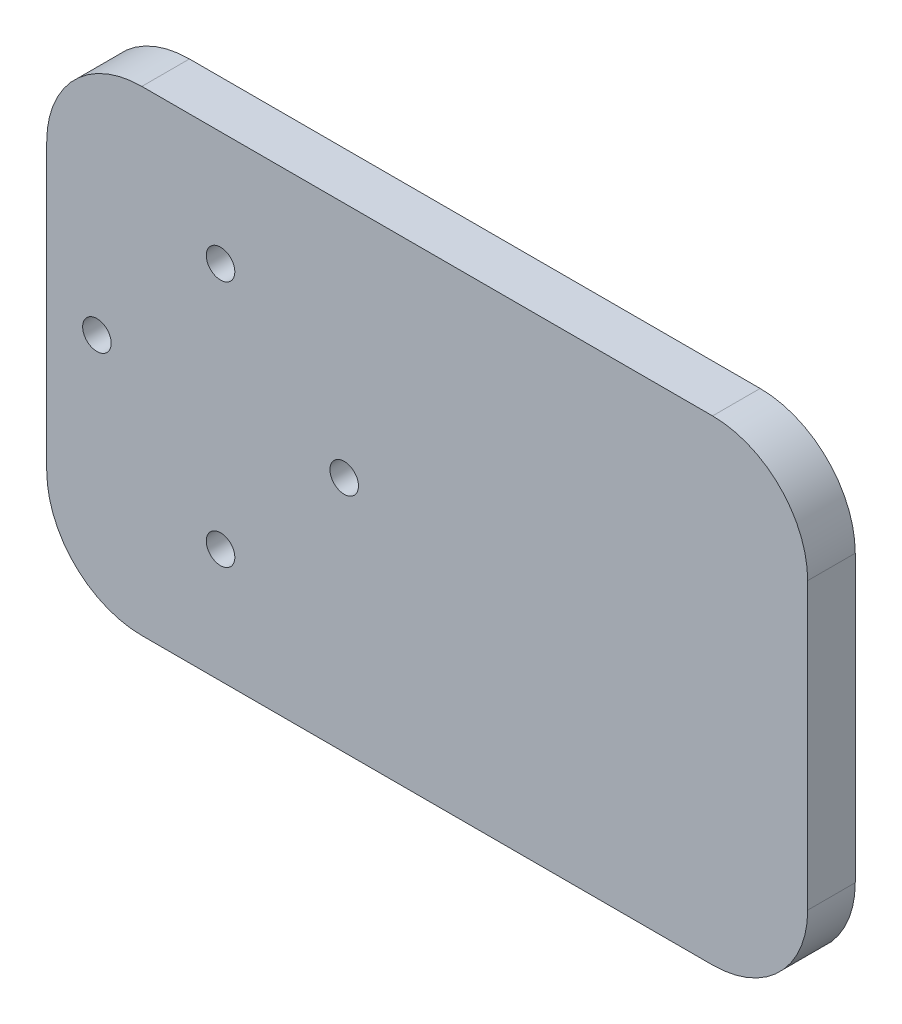
ISO-10303-21;
HEADER;
FILE_DESCRIPTION(('STEP AP214'),'2;1');
FILE_NAME('part.step','',(''),(''),'','','');
FILE_SCHEMA(('AUTOMOTIVE_DESIGN { 1 0 10303 214 1 1 1 1 }'));
ENDSEC;
DATA;
#1=APPLICATION_CONTEXT('core data for automotive mechanical design processes');
#2=APPLICATION_PROTOCOL_DEFINITION('international standard','automotive_design',2000,#1);
#3=PRODUCT_CONTEXT('',#1,'mechanical');
#4=PRODUCT('Part','Part','',(#3));
#5=PRODUCT_RELATED_PRODUCT_CATEGORY('part','',(#4));
#6=PRODUCT_DEFINITION_FORMATION('','',#4);
#7=PRODUCT_DEFINITION_CONTEXT('part definition',#1,'design');
#8=PRODUCT_DEFINITION('design','',#6,#7);
#9=PRODUCT_DEFINITION_SHAPE('','',#8);
#10=(LENGTH_UNIT() NAMED_UNIT(*) SI_UNIT(.MILLI.,.METRE.));
#11=(NAMED_UNIT(*) PLANE_ANGLE_UNIT() SI_UNIT($,.RADIAN.));
#12=(NAMED_UNIT(*) SI_UNIT($,.STERADIAN.) SOLID_ANGLE_UNIT());
#13=UNCERTAINTY_MEASURE_WITH_UNIT(LENGTH_MEASURE(1.E-05),#10,'distance_accuracy_value','');
#14=(GEOMETRIC_REPRESENTATION_CONTEXT(3) GLOBAL_UNCERTAINTY_ASSIGNED_CONTEXT((#13)) GLOBAL_UNIT_ASSIGNED_CONTEXT((#10,
#11,#12)) REPRESENTATION_CONTEXT('',''));
#15=CARTESIAN_POINT('',(0.,0.,0.));
#16=DIRECTION('',(0.,0.,1.));
#17=DIRECTION('',(1.,0.,0.));
#18=AXIS2_PLACEMENT_3D('',#15,#16,#17);
#19=CARTESIAN_POINT('',(40.,25.,5.));
#20=DIRECTION('',(-1.,0.,0.));
#21=DIRECTION('',(0.,0.,1.));
#22=AXIS2_PLACEMENT_3D('',#19,#20,#21);
#23=PLANE('',#22);
#24=DIRECTION('',(0.,1.,0.));
#25=VECTOR('',#24,1.);
#26=CARTESIAN_POINT('',(40.,25.,5.));
#27=LINE('',#26,#25);
#28=CARTESIAN_POINT('',(40.,-15.,5.));
#29=VERTEX_POINT('',#28);
#30=CARTESIAN_POINT('',(40.,15.,5.));
#31=VERTEX_POINT('',#30);
#32=EDGE_CURVE('E127',#29,#31,#27,.T.);
#33=ORIENTED_EDGE('',*,*,#32,.F.);
#34=DIRECTION('',(0.,0.,-1.));
#35=VECTOR('',#34,1.);
#36=CARTESIAN_POINT('',(40.,-15.,5.));
#37=LINE('',#36,#35);
#38=CARTESIAN_POINT('',(40.,-15.,0.));
#39=VERTEX_POINT('',#38);
#40=EDGE_CURVE('E11',#29,#39,#37,.T.);
#41=ORIENTED_EDGE('',*,*,#40,.T.);
#42=DIRECTION('',(0.,1.,0.));
#43=VECTOR('',#42,1.);
#44=CARTESIAN_POINT('',(40.,25.,0.));
#45=LINE('',#44,#43);
#46=CARTESIAN_POINT('',(40.,15.,0.));
#47=VERTEX_POINT('',#46);
#48=EDGE_CURVE('E158',#39,#47,#45,.T.);
#49=ORIENTED_EDGE('',*,*,#48,.T.);
#50=DIRECTION('',(0.,0.,-1.));
#51=VECTOR('',#50,1.);
#52=CARTESIAN_POINT('',(40.,15.,5.));
#53=LINE('',#52,#51);
#54=EDGE_CURVE('E41',#47,#31,#53,.F.);
#55=ORIENTED_EDGE('',*,*,#54,.T.);
#56=EDGE_LOOP('',(#33,#41,#49,#55));
#57=FACE_BOUND('',#56,.T.);
#58=ADVANCED_FACE('F33',(#57),#23,.F.);
#59=CARTESIAN_POINT('',(-40.,25.,5.));
#60=DIRECTION('',(0.,-1.,0.));
#61=DIRECTION('',(0.,0.,-1.));
#62=AXIS2_PLACEMENT_3D('',#59,#60,#61);
#63=PLANE('',#62);
#64=DIRECTION('',(-1.,0.,0.));
#65=VECTOR('',#64,1.);
#66=CARTESIAN_POINT('',(-40.,25.,0.));
#67=LINE('',#66,#65);
#68=CARTESIAN_POINT('',(30.,25.,0.));
#69=VERTEX_POINT('',#68);
#70=CARTESIAN_POINT('',(-30.,25.,0.));
#71=VERTEX_POINT('',#70);
#72=EDGE_CURVE('E132',#69,#71,#67,.T.);
#73=ORIENTED_EDGE('',*,*,#72,.T.);
#74=DIRECTION('',(0.,0.,-1.));
#75=VECTOR('',#74,1.);
#76=CARTESIAN_POINT('',(-30.,25.,5.));
#77=LINE('',#76,#75);
#78=CARTESIAN_POINT('',(-30.,25.,5.));
#79=VERTEX_POINT('',#78);
#80=EDGE_CURVE('E48',#71,#79,#77,.F.);
#81=ORIENTED_EDGE('',*,*,#80,.T.);
#82=DIRECTION('',(-1.,0.,0.));
#83=VECTOR('',#82,1.);
#84=CARTESIAN_POINT('',(-40.,25.,5.));
#85=LINE('',#84,#83);
#86=CARTESIAN_POINT('',(30.,25.,5.));
#87=VERTEX_POINT('',#86);
#88=EDGE_CURVE('E130',#87,#79,#85,.T.);
#89=ORIENTED_EDGE('',*,*,#88,.F.);
#90=DIRECTION('',(0.,0.,-1.));
#91=VECTOR('',#90,1.);
#92=CARTESIAN_POINT('',(30.,25.,5.));
#93=LINE('',#92,#91);
#94=EDGE_CURVE('E150',#87,#69,#93,.T.);
#95=ORIENTED_EDGE('',*,*,#94,.T.);
#96=EDGE_LOOP('',(#73,#81,#89,#95));
#97=FACE_BOUND('',#96,.T.);
#98=ADVANCED_FACE('F165',(#97),#63,.F.);
#99=CARTESIAN_POINT('',(-40.,25.,5.));
#100=DIRECTION('',(1.,0.,0.));
#101=DIRECTION('',(0.,1.,0.));
#102=AXIS2_PLACEMENT_3D('',#99,#100,#101);
#103=PLANE('',#102);
#104=DIRECTION('',(0.,-1.,0.));
#105=VECTOR('',#104,1.);
#106=CARTESIAN_POINT('',(-40.,25.,0.));
#107=LINE('',#106,#105);
#108=CARTESIAN_POINT('',(-40.,15.,0.));
#109=VERTEX_POINT('',#108);
#110=CARTESIAN_POINT('',(-40.,-15.,0.));
#111=VERTEX_POINT('',#110);
#112=EDGE_CURVE('E128',#109,#111,#107,.T.);
#113=ORIENTED_EDGE('',*,*,#112,.T.);
#114=DIRECTION('',(0.,0.,-1.));
#115=VECTOR('',#114,1.);
#116=CARTESIAN_POINT('',(-40.,-15.,5.));
#117=LINE('',#116,#115);
#118=CARTESIAN_POINT('',(-40.,-15.,5.));
#119=VERTEX_POINT('',#118);
#120=EDGE_CURVE('E105',#111,#119,#117,.F.);
#121=ORIENTED_EDGE('',*,*,#120,.T.);
#122=DIRECTION('',(0.,-1.,0.));
#123=VECTOR('',#122,1.);
#124=CARTESIAN_POINT('',(-40.,25.,5.));
#125=LINE('',#124,#123);
#126=CARTESIAN_POINT('',(-40.,15.,5.));
#127=VERTEX_POINT('',#126);
#128=EDGE_CURVE('E170',#127,#119,#125,.T.);
#129=ORIENTED_EDGE('',*,*,#128,.F.);
#130=DIRECTION('',(0.,0.,-1.));
#131=VECTOR('',#130,1.);
#132=CARTESIAN_POINT('',(-40.,15.,5.));
#133=LINE('',#132,#131);
#134=EDGE_CURVE('E110',#127,#109,#133,.T.);
#135=ORIENTED_EDGE('',*,*,#134,.T.);
#136=EDGE_LOOP('',(#113,#121,#129,#135));
#137=FACE_BOUND('',#136,.T.);
#138=ADVANCED_FACE('F233',(#137),#103,.F.);
#139=CARTESIAN_POINT('',(-40.,-25.,5.));
#140=DIRECTION('',(0.,1.,0.));
#141=DIRECTION('',(0.,0.,1.));
#142=AXIS2_PLACEMENT_3D('',#139,#140,#141);
#143=PLANE('',#142);
#144=DIRECTION('',(1.,0.,0.));
#145=VECTOR('',#144,1.);
#146=CARTESIAN_POINT('',(-40.,-25.,5.));
#147=LINE('',#146,#145);
#148=CARTESIAN_POINT('',(-30.,-25.,5.));
#149=VERTEX_POINT('',#148);
#150=CARTESIAN_POINT('',(30.,-25.,5.));
#151=VERTEX_POINT('',#150);
#152=EDGE_CURVE('E120',#149,#151,#147,.T.);
#153=ORIENTED_EDGE('',*,*,#152,.F.);
#154=DIRECTION('',(0.,0.,-1.));
#155=VECTOR('',#154,1.);
#156=CARTESIAN_POINT('',(-30.,-25.,5.));
#157=LINE('',#156,#155);
#158=CARTESIAN_POINT('',(-30.,-25.,0.));
#159=VERTEX_POINT('',#158);
#160=EDGE_CURVE('E104',#149,#159,#157,.T.);
#161=ORIENTED_EDGE('',*,*,#160,.T.);
#162=DIRECTION('',(1.,0.,0.));
#163=VECTOR('',#162,1.);
#164=CARTESIAN_POINT('',(-40.,-25.,0.));
#165=LINE('',#164,#163);
#166=CARTESIAN_POINT('',(30.,-25.,0.));
#167=VERTEX_POINT('',#166);
#168=EDGE_CURVE('E117',#159,#167,#165,.T.);
#169=ORIENTED_EDGE('',*,*,#168,.T.);
#170=DIRECTION('',(0.,0.,-1.));
#171=VECTOR('',#170,1.);
#172=CARTESIAN_POINT('',(30.,-25.,5.));
#173=LINE('',#172,#171);
#174=EDGE_CURVE('E122',#167,#151,#173,.F.);
#175=ORIENTED_EDGE('',*,*,#174,.T.);
#176=EDGE_LOOP('',(#153,#161,#169,#175));
#177=FACE_BOUND('',#176,.T.);
#178=ADVANCED_FACE('F116',(#177),#143,.F.);
#179=CARTESIAN_POINT('',(0.,0.,5.));
#180=DIRECTION('',(0.,0.,1.));
#181=DIRECTION('',(1.,0.,0.));
#182=AXIS2_PLACEMENT_3D('',#179,#180,#181);
#183=PLANE('',#182);
#184=CARTESIAN_POINT('',(-34.7271822940433,0.,5.));
#185=DIRECTION('',(0.,0.,1.));
#186=DIRECTION('',(1.,0.,0.));
#187=AXIS2_PLACEMENT_3D('',#184,#185,#186);
#188=CIRCLE('',#187,1.5);
#189=CARTESIAN_POINT('',(-33.2271822940433,0.,5.));
#190=VERTEX_POINT('',#189);
#191=EDGE_CURVE('E191',#190,#190,#188,.T.);
#192=ORIENTED_EDGE('',*,*,#191,.F.);
#193=EDGE_LOOP('',(#192));
#194=FACE_BOUND('',#193,.T.);
#195=CARTESIAN_POINT('',(-21.7271822940433,-13.,5.));
#196=DIRECTION('',(0.,0.,1.));
#197=DIRECTION('',(1.,0.,0.));
#198=AXIS2_PLACEMENT_3D('',#195,#196,#197);
#199=CIRCLE('',#198,1.5);
#200=CARTESIAN_POINT('',(-20.2271822940433,-13.,5.));
#201=VERTEX_POINT('',#200);
#202=EDGE_CURVE('E185',#201,#201,#199,.T.);
#203=ORIENTED_EDGE('',*,*,#202,.F.);
#204=EDGE_LOOP('',(#203));
#205=FACE_BOUND('',#204,.T.);
#206=CARTESIAN_POINT('',(-8.72718229404334,0.,5.));
#207=DIRECTION('',(0.,0.,1.));
#208=DIRECTION('',(1.,0.,0.));
#209=AXIS2_PLACEMENT_3D('',#206,#207,#208);
#210=CIRCLE('',#209,1.5);
#211=CARTESIAN_POINT('',(-7.22718229404334,0.,5.));
#212=VERTEX_POINT('',#211);
#213=EDGE_CURVE('E179',#212,#212,#210,.T.);
#214=ORIENTED_EDGE('',*,*,#213,.F.);
#215=EDGE_LOOP('',(#214));
#216=FACE_BOUND('',#215,.T.);
#217=CARTESIAN_POINT('',(-21.7271822940433,13.,5.));
#218=DIRECTION('',(0.,0.,1.));
#219=DIRECTION('',(1.,0.,0.));
#220=AXIS2_PLACEMENT_3D('',#217,#218,#219);
#221=CIRCLE('',#220,1.5);
#222=CARTESIAN_POINT('',(-20.2271822940433,13.,5.));
#223=VERTEX_POINT('',#222);
#224=EDGE_CURVE('E173',#223,#223,#221,.T.);
#225=ORIENTED_EDGE('',*,*,#224,.F.);
#226=EDGE_LOOP('',(#225));
#227=FACE_BOUND('',#226,.T.);
#228=ORIENTED_EDGE('',*,*,#128,.T.);
#229=CARTESIAN_POINT('',(-30.,-15.,5.));
#230=DIRECTION('',(0.,0.,1.));
#231=DIRECTION('',(1.,0.,0.));
#232=AXIS2_PLACEMENT_3D('',#229,#230,#231);
#233=CIRCLE('',#232,10.);
#234=EDGE_CURVE('E148',#119,#149,#233,.T.);
#235=ORIENTED_EDGE('',*,*,#234,.T.);
#236=ORIENTED_EDGE('',*,*,#152,.T.);
#237=CARTESIAN_POINT('',(30.,-15.,5.));
#238=DIRECTION('',(0.,0.,1.));
#239=DIRECTION('',(1.,0.,0.));
#240=AXIS2_PLACEMENT_3D('',#237,#238,#239);
#241=CIRCLE('',#240,10.);
#242=EDGE_CURVE('E144',#151,#29,#241,.T.);
#243=ORIENTED_EDGE('',*,*,#242,.T.);
#244=ORIENTED_EDGE('',*,*,#32,.T.);
#245=CARTESIAN_POINT('',(30.,15.,5.));
#246=DIRECTION('',(0.,0.,1.));
#247=DIRECTION('',(1.,0.,0.));
#248=AXIS2_PLACEMENT_3D('',#245,#246,#247);
#249=CIRCLE('',#248,10.);
#250=EDGE_CURVE('E55',#31,#87,#249,.T.);
#251=ORIENTED_EDGE('',*,*,#250,.T.);
#252=ORIENTED_EDGE('',*,*,#88,.T.);
#253=CARTESIAN_POINT('',(-30.,15.,5.));
#254=DIRECTION('',(0.,0.,1.));
#255=DIRECTION('',(1.,0.,0.));
#256=AXIS2_PLACEMENT_3D('',#253,#254,#255);
#257=CIRCLE('',#256,10.);
#258=EDGE_CURVE('E146',#79,#127,#257,.T.);
#259=ORIENTED_EDGE('',*,*,#258,.T.);
#260=EDGE_LOOP('',(#228,#235,#236,#243,#244,#251,#252,#259));
#261=FACE_BOUND('',#260,.T.);
#262=ADVANCED_FACE('F161',(#194,#205,#216,#227,#261),#183,.T.);
#263=CARTESIAN_POINT('',(0.,0.,0.));
#264=DIRECTION('',(0.,0.,1.));
#265=DIRECTION('',(1.,0.,0.));
#266=AXIS2_PLACEMENT_3D('',#263,#264,#265);
#267=PLANE('',#266);
#268=CARTESIAN_POINT('',(-34.7271822940433,0.,0.));
#269=DIRECTION('',(0.,0.,1.));
#270=DIRECTION('',(1.,0.,0.));
#271=AXIS2_PLACEMENT_3D('',#268,#269,#270);
#272=CIRCLE('',#271,1.5);
#273=CARTESIAN_POINT('',(-33.2271822940433,0.,0.));
#274=VERTEX_POINT('',#273);
#275=EDGE_CURVE('E188',#274,#274,#272,.T.);
#276=ORIENTED_EDGE('',*,*,#275,.T.);
#277=EDGE_LOOP('',(#276));
#278=FACE_BOUND('',#277,.T.);
#279=CARTESIAN_POINT('',(-21.7271822940433,-13.,0.));
#280=DIRECTION('',(0.,0.,1.));
#281=DIRECTION('',(1.,0.,0.));
#282=AXIS2_PLACEMENT_3D('',#279,#280,#281);
#283=CIRCLE('',#282,1.5);
#284=CARTESIAN_POINT('',(-20.2271822940433,-13.,0.));
#285=VERTEX_POINT('',#284);
#286=EDGE_CURVE('E182',#285,#285,#283,.T.);
#287=ORIENTED_EDGE('',*,*,#286,.T.);
#288=EDGE_LOOP('',(#287));
#289=FACE_BOUND('',#288,.T.);
#290=CARTESIAN_POINT('',(-8.72718229404334,0.,0.));
#291=DIRECTION('',(0.,0.,1.));
#292=DIRECTION('',(1.,0.,0.));
#293=AXIS2_PLACEMENT_3D('',#290,#291,#292);
#294=CIRCLE('',#293,1.5);
#295=CARTESIAN_POINT('',(-7.22718229404334,0.,0.));
#296=VERTEX_POINT('',#295);
#297=EDGE_CURVE('E176',#296,#296,#294,.T.);
#298=ORIENTED_EDGE('',*,*,#297,.T.);
#299=EDGE_LOOP('',(#298));
#300=FACE_BOUND('',#299,.T.);
#301=CARTESIAN_POINT('',(-21.7271822940433,13.,0.));
#302=DIRECTION('',(0.,0.,1.));
#303=DIRECTION('',(1.,0.,0.));
#304=AXIS2_PLACEMENT_3D('',#301,#302,#303);
#305=CIRCLE('',#304,1.5);
#306=CARTESIAN_POINT('',(-20.2271822940433,13.,0.));
#307=VERTEX_POINT('',#306);
#308=EDGE_CURVE('E166',#307,#307,#305,.T.);
#309=ORIENTED_EDGE('',*,*,#308,.T.);
#310=EDGE_LOOP('',(#309));
#311=FACE_BOUND('',#310,.T.);
#312=ORIENTED_EDGE('',*,*,#168,.F.);
#313=CARTESIAN_POINT('',(-30.,-15.,0.));
#314=DIRECTION('',(0.,0.,1.));
#315=DIRECTION('',(1.,0.,0.));
#316=AXIS2_PLACEMENT_3D('',#313,#314,#315);
#317=CIRCLE('',#316,10.);
#318=EDGE_CURVE('E100',#159,#111,#317,.F.);
#319=ORIENTED_EDGE('',*,*,#318,.T.);
#320=ORIENTED_EDGE('',*,*,#112,.F.);
#321=CARTESIAN_POINT('',(-30.,15.,0.));
#322=DIRECTION('',(0.,0.,1.));
#323=DIRECTION('',(1.,0.,0.));
#324=AXIS2_PLACEMENT_3D('',#321,#322,#323);
#325=CIRCLE('',#324,10.);
#326=EDGE_CURVE('E111',#109,#71,#325,.F.);
#327=ORIENTED_EDGE('',*,*,#326,.T.);
#328=ORIENTED_EDGE('',*,*,#72,.F.);
#329=CARTESIAN_POINT('',(30.,15.,0.));
#330=DIRECTION('',(0.,0.,1.));
#331=DIRECTION('',(1.,0.,0.));
#332=AXIS2_PLACEMENT_3D('',#329,#330,#331);
#333=CIRCLE('',#332,10.);
#334=EDGE_CURVE('E121',#69,#47,#333,.F.);
#335=ORIENTED_EDGE('',*,*,#334,.T.);
#336=ORIENTED_EDGE('',*,*,#48,.F.);
#337=CARTESIAN_POINT('',(30.,-15.,0.));
#338=DIRECTION('',(0.,0.,1.));
#339=DIRECTION('',(1.,0.,0.));
#340=AXIS2_PLACEMENT_3D('',#337,#338,#339);
#341=CIRCLE('',#340,10.);
#342=EDGE_CURVE('E126',#39,#167,#341,.F.);
#343=ORIENTED_EDGE('',*,*,#342,.T.);
#344=EDGE_LOOP('',(#312,#319,#320,#327,#328,#335,#336,#343));
#345=FACE_BOUND('',#344,.T.);
#346=ADVANCED_FACE('F124',(#278,#289,#300,#311,#345),#267,.F.);
#347=CARTESIAN_POINT('',(-21.7271822940433,13.,0.));
#348=DIRECTION('',(0.,0.,1.));
#349=DIRECTION('',(1.,0.,0.));
#350=AXIS2_PLACEMENT_3D('',#347,#348,#349);
#351=CYLINDRICAL_SURFACE('',#350,1.5);
#352=ORIENTED_EDGE('',*,*,#308,.F.);
#353=EDGE_LOOP('',(#352));
#354=FACE_BOUND('',#353,.T.);
#355=ORIENTED_EDGE('',*,*,#224,.T.);
#356=EDGE_LOOP('',(#355));
#357=FACE_BOUND('',#356,.T.);
#358=ADVANCED_FACE('F215',(#354,#357),#351,.F.);
#359=CARTESIAN_POINT('',(-8.72718229404334,0.,0.));
#360=DIRECTION('',(0.,0.,1.));
#361=DIRECTION('',(1.,0.,0.));
#362=AXIS2_PLACEMENT_3D('',#359,#360,#361);
#363=CYLINDRICAL_SURFACE('',#362,1.5);
#364=ORIENTED_EDGE('',*,*,#297,.F.);
#365=EDGE_LOOP('',(#364));
#366=FACE_BOUND('',#365,.T.);
#367=ORIENTED_EDGE('',*,*,#213,.T.);
#368=EDGE_LOOP('',(#367));
#369=FACE_BOUND('',#368,.T.);
#370=ADVANCED_FACE('F217',(#366,#369),#363,.F.);
#371=CARTESIAN_POINT('',(-21.7271822940433,-13.,0.));
#372=DIRECTION('',(0.,0.,1.));
#373=DIRECTION('',(1.,0.,0.));
#374=AXIS2_PLACEMENT_3D('',#371,#372,#373);
#375=CYLINDRICAL_SURFACE('',#374,1.5);
#376=ORIENTED_EDGE('',*,*,#286,.F.);
#377=EDGE_LOOP('',(#376));
#378=FACE_BOUND('',#377,.T.);
#379=ORIENTED_EDGE('',*,*,#202,.T.);
#380=EDGE_LOOP('',(#379));
#381=FACE_BOUND('',#380,.T.);
#382=ADVANCED_FACE('F202',(#378,#381),#375,.F.);
#383=CARTESIAN_POINT('',(-34.7271822940433,0.,0.));
#384=DIRECTION('',(0.,0.,1.));
#385=DIRECTION('',(1.,0.,0.));
#386=AXIS2_PLACEMENT_3D('',#383,#384,#385);
#387=CYLINDRICAL_SURFACE('',#386,1.5);
#388=ORIENTED_EDGE('',*,*,#275,.F.);
#389=EDGE_LOOP('',(#388));
#390=FACE_BOUND('',#389,.T.);
#391=ORIENTED_EDGE('',*,*,#191,.T.);
#392=EDGE_LOOP('',(#391));
#393=FACE_BOUND('',#392,.T.);
#394=ADVANCED_FACE('F199',(#390,#393),#387,.F.);
#395=CARTESIAN_POINT('',(-30.,-15.,5.));
#396=DIRECTION('',(0.,0.,-1.));
#397=DIRECTION('',(-1.,0.,0.));
#398=AXIS2_PLACEMENT_3D('',#395,#396,#397);
#399=CYLINDRICAL_SURFACE('',#398,10.);
#400=ORIENTED_EDGE('',*,*,#234,.F.);
#401=ORIENTED_EDGE('',*,*,#120,.F.);
#402=ORIENTED_EDGE('',*,*,#318,.F.);
#403=ORIENTED_EDGE('',*,*,#160,.F.);
#404=EDGE_LOOP('',(#400,#401,#402,#403));
#405=FACE_BOUND('',#404,.T.);
#406=ADVANCED_FACE('F103',(#405),#399,.T.);
#407=CARTESIAN_POINT('',(-30.,15.,5.));
#408=DIRECTION('',(0.,0.,-1.));
#409=DIRECTION('',(-1.,0.,0.));
#410=AXIS2_PLACEMENT_3D('',#407,#408,#409);
#411=CYLINDRICAL_SURFACE('',#410,10.);
#412=ORIENTED_EDGE('',*,*,#258,.F.);
#413=ORIENTED_EDGE('',*,*,#80,.F.);
#414=ORIENTED_EDGE('',*,*,#326,.F.);
#415=ORIENTED_EDGE('',*,*,#134,.F.);
#416=EDGE_LOOP('',(#412,#413,#414,#415));
#417=FACE_BOUND('',#416,.T.);
#418=ADVANCED_FACE('F239',(#417),#411,.T.);
#419=CARTESIAN_POINT('',(30.,-15.,5.));
#420=DIRECTION('',(0.,0.,-1.));
#421=DIRECTION('',(-1.,0.,0.));
#422=AXIS2_PLACEMENT_3D('',#419,#420,#421);
#423=CYLINDRICAL_SURFACE('',#422,10.);
#424=ORIENTED_EDGE('',*,*,#242,.F.);
#425=ORIENTED_EDGE('',*,*,#174,.F.);
#426=ORIENTED_EDGE('',*,*,#342,.F.);
#427=ORIENTED_EDGE('',*,*,#40,.F.);
#428=EDGE_LOOP('',(#424,#425,#426,#427));
#429=FACE_BOUND('',#428,.T.);
#430=ADVANCED_FACE('F241',(#429),#423,.T.);
#431=CARTESIAN_POINT('',(30.,15.,5.));
#432=DIRECTION('',(0.,0.,-1.));
#433=DIRECTION('',(-1.,0.,0.));
#434=AXIS2_PLACEMENT_3D('',#431,#432,#433);
#435=CYLINDRICAL_SURFACE('',#434,10.);
#436=ORIENTED_EDGE('',*,*,#250,.F.);
#437=ORIENTED_EDGE('',*,*,#54,.F.);
#438=ORIENTED_EDGE('',*,*,#334,.F.);
#439=ORIENTED_EDGE('',*,*,#94,.F.);
#440=EDGE_LOOP('',(#436,#437,#438,#439));
#441=FACE_BOUND('',#440,.T.);
#442=ADVANCED_FACE('F35',(#441),#435,.T.);
#443=CLOSED_SHELL('',(#58,#98,#138,#178,#262,#346,#358,#370,#382,#394,#406,#418,#430,#442));
#444=MANIFOLD_SOLID_BREP('B2',#443);
#445=ADVANCED_BREP_SHAPE_REPRESENTATION('',(#18,#444),#14);
#446=SHAPE_DEFINITION_REPRESENTATION(#9,#445);
ENDSEC;
END-ISO-10303-21;
